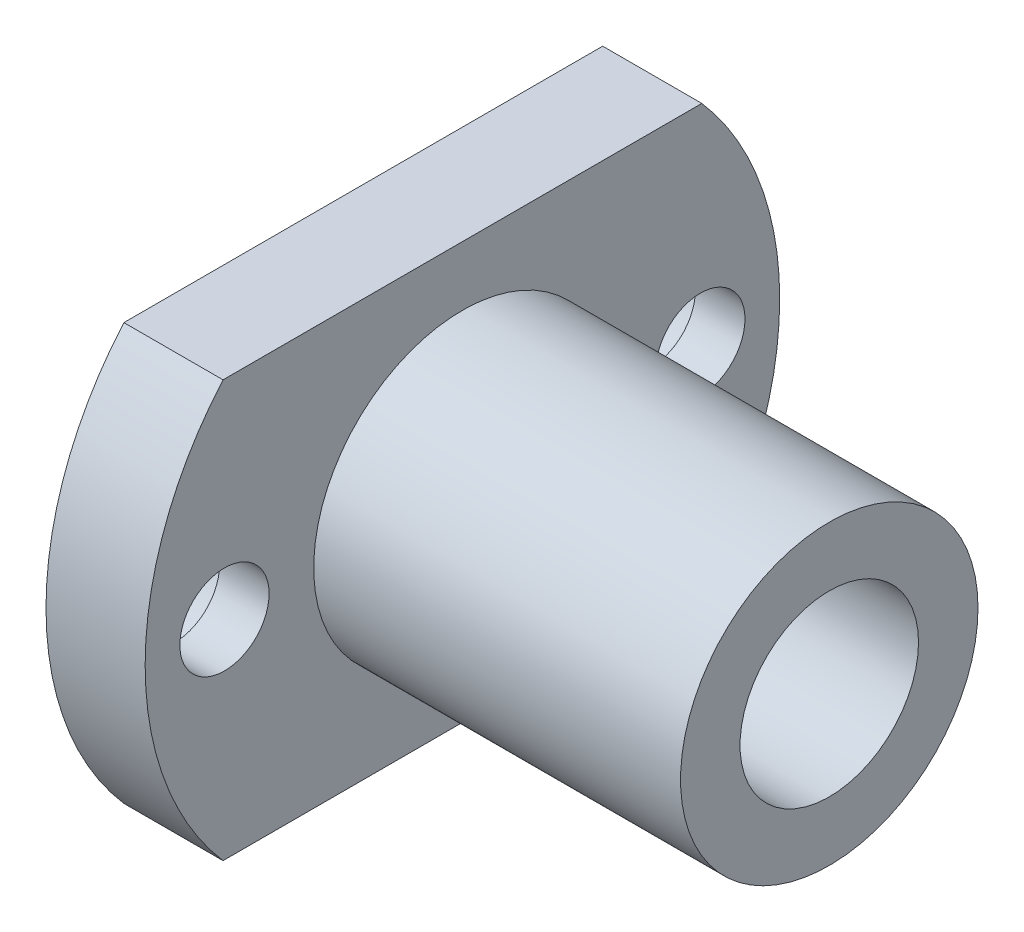
ISO-10303-21;
HEADER;
FILE_DESCRIPTION(('STEP AP214'),'2;1');
FILE_NAME('part.step','',(''),(''),'','','');
FILE_SCHEMA(('AUTOMOTIVE_DESIGN { 1 0 10303 214 1 1 1 1 }'));
ENDSEC;
DATA;
#1=APPLICATION_CONTEXT('core data for automotive mechanical design processes');
#2=APPLICATION_PROTOCOL_DEFINITION('international standard','automotive_design',2000,#1);
#3=PRODUCT_CONTEXT('',#1,'mechanical');
#4=PRODUCT('Part','Part','',(#3));
#5=PRODUCT_RELATED_PRODUCT_CATEGORY('part','',(#4));
#6=PRODUCT_DEFINITION_FORMATION('','',#4);
#7=PRODUCT_DEFINITION_CONTEXT('part definition',#1,'design');
#8=PRODUCT_DEFINITION('design','',#6,#7);
#9=PRODUCT_DEFINITION_SHAPE('','',#8);
#10=(LENGTH_UNIT() NAMED_UNIT(*) SI_UNIT(.MILLI.,.METRE.));
#11=(NAMED_UNIT(*) PLANE_ANGLE_UNIT() SI_UNIT($,.RADIAN.));
#12=(NAMED_UNIT(*) SI_UNIT($,.STERADIAN.) SOLID_ANGLE_UNIT());
#13=UNCERTAINTY_MEASURE_WITH_UNIT(LENGTH_MEASURE(1.E-05),#10,'distance_accuracy_value','');
#14=(GEOMETRIC_REPRESENTATION_CONTEXT(3) GLOBAL_UNCERTAINTY_ASSIGNED_CONTEXT((#13)) GLOBAL_UNIT_ASSIGNED_CONTEXT((#10,
#11,#12)) REPRESENTATION_CONTEXT('',''));
#15=CARTESIAN_POINT('',(0.,0.,0.));
#16=DIRECTION('',(0.,0.,1.));
#17=DIRECTION('',(1.,0.,0.));
#18=AXIS2_PLACEMENT_3D('',#15,#16,#17);
#19=CARTESIAN_POINT('',(5.,0.,0.));
#20=DIRECTION('',(-1.,0.,0.));
#21=DIRECTION('',(0.,0.,1.));
#22=AXIS2_PLACEMENT_3D('',#19,#20,#21);
#23=CYLINDRICAL_SURFACE('',#22,16.);
#24=CARTESIAN_POINT('',(0.,0.,0.));
#25=DIRECTION('',(1.,0.,0.));
#26=DIRECTION('',(0.,0.,-1.));
#27=AXIS2_PLACEMENT_3D('',#24,#25,#26);
#28=CIRCLE('',#27,16.);
#29=CARTESIAN_POINT('',(0.,10.5,12.0726964676496));
#30=VERTEX_POINT('',#29);
#31=CARTESIAN_POINT('',(0.,-10.5,12.0726964676496));
#32=VERTEX_POINT('',#31);
#33=EDGE_CURVE('E104',#30,#32,#28,.T.);
#34=ORIENTED_EDGE('',*,*,#33,.T.);
#35=DIRECTION('',(-1.,0.,0.));
#36=VECTOR('',#35,1.);
#37=CARTESIAN_POINT('',(5.,-10.5,12.0726964676496));
#38=LINE('',#37,#36);
#39=CARTESIAN_POINT('',(5.,-10.5,12.0726964676496));
#40=VERTEX_POINT('',#39);
#41=EDGE_CURVE('E11',#40,#32,#38,.T.);
#42=ORIENTED_EDGE('',*,*,#41,.F.);
#43=CARTESIAN_POINT('',(5.,0.,0.));
#44=DIRECTION('',(1.,0.,0.));
#45=DIRECTION('',(0.,0.,-1.));
#46=AXIS2_PLACEMENT_3D('',#43,#44,#45);
#47=CIRCLE('',#46,16.);
#48=CARTESIAN_POINT('',(5.,10.5,12.0726964676496));
#49=VERTEX_POINT('',#48);
#50=EDGE_CURVE('E92',#49,#40,#47,.T.);
#51=ORIENTED_EDGE('',*,*,#50,.F.);
#52=DIRECTION('',(-1.,0.,0.));
#53=VECTOR('',#52,1.);
#54=CARTESIAN_POINT('',(5.,10.5,12.0726964676496));
#55=LINE('',#54,#53);
#56=EDGE_CURVE('E100',#49,#30,#55,.T.);
#57=ORIENTED_EDGE('',*,*,#56,.T.);
#58=EDGE_LOOP('',(#34,#42,#51,#57));
#59=FACE_BOUND('',#58,.T.);
#60=ADVANCED_FACE('F41',(#59),#23,.T.);
#61=CARTESIAN_POINT('',(5.,-10.5,12.0726964676496));
#62=DIRECTION('',(0.,1.,0.));
#63=DIRECTION('',(0.,0.,1.));
#64=AXIS2_PLACEMENT_3D('',#61,#62,#63);
#65=PLANE('',#64);
#66=DIRECTION('',(0.,0.,-1.));
#67=VECTOR('',#66,1.);
#68=CARTESIAN_POINT('',(0.,-10.5,12.0726964676496));
#69=LINE('',#68,#67);
#70=CARTESIAN_POINT('',(0.,-10.5,-12.0726964676496));
#71=VERTEX_POINT('',#70);
#72=EDGE_CURVE('E96',#32,#71,#69,.T.);
#73=ORIENTED_EDGE('',*,*,#72,.T.);
#74=DIRECTION('',(-1.,0.,0.));
#75=VECTOR('',#74,1.);
#76=CARTESIAN_POINT('',(5.,-10.5,-12.0726964676496));
#77=LINE('',#76,#75);
#78=CARTESIAN_POINT('',(5.,-10.5,-12.0726964676496));
#79=VERTEX_POINT('',#78);
#80=EDGE_CURVE('E49',#79,#71,#77,.T.);
#81=ORIENTED_EDGE('',*,*,#80,.F.);
#82=DIRECTION('',(0.,0.,-1.));
#83=VECTOR('',#82,1.);
#84=CARTESIAN_POINT('',(5.,-10.5,12.0726964676496));
#85=LINE('',#84,#83);
#86=EDGE_CURVE('E87',#40,#79,#85,.T.);
#87=ORIENTED_EDGE('',*,*,#86,.F.);
#88=ORIENTED_EDGE('',*,*,#41,.T.);
#89=EDGE_LOOP('',(#73,#81,#87,#88));
#90=FACE_BOUND('',#89,.T.);
#91=ADVANCED_FACE('F95',(#90),#65,.F.);
#92=CARTESIAN_POINT('',(5.,0.,0.));
#93=DIRECTION('',(-1.,0.,0.));
#94=DIRECTION('',(0.,0.,1.));
#95=AXIS2_PLACEMENT_3D('',#92,#93,#94);
#96=CYLINDRICAL_SURFACE('',#95,16.);
#97=CARTESIAN_POINT('',(0.,0.,0.));
#98=DIRECTION('',(1.,0.,0.));
#99=DIRECTION('',(0.,0.,-1.));
#100=AXIS2_PLACEMENT_3D('',#97,#98,#99);
#101=CIRCLE('',#100,16.);
#102=CARTESIAN_POINT('',(0.,10.5,-12.0726964676496));
#103=VERTEX_POINT('',#102);
#104=EDGE_CURVE('E74',#71,#103,#101,.T.);
#105=ORIENTED_EDGE('',*,*,#104,.T.);
#106=DIRECTION('',(-1.,0.,0.));
#107=VECTOR('',#106,1.);
#108=CARTESIAN_POINT('',(5.,10.5,-12.0726964676496));
#109=LINE('',#108,#107);
#110=CARTESIAN_POINT('',(5.,10.5,-12.0726964676496));
#111=VERTEX_POINT('',#110);
#112=EDGE_CURVE('E97',#111,#103,#109,.T.);
#113=ORIENTED_EDGE('',*,*,#112,.F.);
#114=CARTESIAN_POINT('',(5.,0.,0.));
#115=DIRECTION('',(1.,0.,0.));
#116=DIRECTION('',(0.,0.,-1.));
#117=AXIS2_PLACEMENT_3D('',#114,#115,#116);
#118=CIRCLE('',#117,16.);
#119=EDGE_CURVE('E90',#79,#111,#118,.T.);
#120=ORIENTED_EDGE('',*,*,#119,.F.);
#121=ORIENTED_EDGE('',*,*,#80,.T.);
#122=EDGE_LOOP('',(#105,#113,#120,#121));
#123=FACE_BOUND('',#122,.T.);
#124=ADVANCED_FACE('F98',(#123),#96,.T.);
#125=CARTESIAN_POINT('',(5.,10.5,12.0726964676496));
#126=DIRECTION('',(0.,-1.,0.));
#127=DIRECTION('',(0.,0.,-1.));
#128=AXIS2_PLACEMENT_3D('',#125,#126,#127);
#129=PLANE('',#128);
#130=DIRECTION('',(0.,0.,1.));
#131=VECTOR('',#130,1.);
#132=CARTESIAN_POINT('',(0.,10.5,12.0726964676496));
#133=LINE('',#132,#131);
#134=EDGE_CURVE('E80',#103,#30,#133,.T.);
#135=ORIENTED_EDGE('',*,*,#134,.T.);
#136=ORIENTED_EDGE('',*,*,#56,.F.);
#137=DIRECTION('',(0.,0.,1.));
#138=VECTOR('',#137,1.);
#139=CARTESIAN_POINT('',(5.,10.5,12.0726964676496));
#140=LINE('',#139,#138);
#141=EDGE_CURVE('E57',#111,#49,#140,.T.);
#142=ORIENTED_EDGE('',*,*,#141,.F.);
#143=ORIENTED_EDGE('',*,*,#112,.T.);
#144=EDGE_LOOP('',(#135,#136,#142,#143));
#145=FACE_BOUND('',#144,.T.);
#146=ADVANCED_FACE('F112',(#145),#129,.F.);
#147=CARTESIAN_POINT('',(5.,0.,0.));
#148=DIRECTION('',(1.,0.,0.));
#149=DIRECTION('',(0.,0.,-1.));
#150=AXIS2_PLACEMENT_3D('',#147,#148,#149);
#151=PLANE('',#150);
#152=CARTESIAN_POINT('',(5.,0.,0.));
#153=DIRECTION('',(1.,0.,0.));
#154=DIRECTION('',(0.,0.,-1.));
#155=AXIS2_PLACEMENT_3D('',#152,#153,#154);
#156=CIRCLE('',#155,7.5);
#157=CARTESIAN_POINT('',(5.,0.,-7.5));
#158=VERTEX_POINT('',#157);
#159=EDGE_CURVE('E132',#158,#158,#156,.T.);
#160=ORIENTED_EDGE('',*,*,#159,.F.);
#161=EDGE_LOOP('',(#160));
#162=FACE_BOUND('',#161,.T.);
#163=CARTESIAN_POINT('',(5.,0.,12.));
#164=DIRECTION('',(1.,0.,0.));
#165=DIRECTION('',(0.,0.,-1.));
#166=AXIS2_PLACEMENT_3D('',#163,#164,#165);
#167=CIRCLE('',#166,2.25);
#168=CARTESIAN_POINT('',(5.,0.,9.75));
#169=VERTEX_POINT('',#168);
#170=EDGE_CURVE('E107',#169,#169,#167,.T.);
#171=ORIENTED_EDGE('',*,*,#170,.F.);
#172=EDGE_LOOP('',(#171));
#173=FACE_BOUND('',#172,.T.);
#174=CARTESIAN_POINT('',(5.,0.,-12.));
#175=DIRECTION('',(1.,0.,0.));
#176=DIRECTION('',(0.,0.,-1.));
#177=AXIS2_PLACEMENT_3D('',#174,#175,#176);
#178=CIRCLE('',#177,2.25);
#179=CARTESIAN_POINT('',(5.,0.,-14.25));
#180=VERTEX_POINT('',#179);
#181=EDGE_CURVE('E123',#180,#180,#178,.T.);
#182=ORIENTED_EDGE('',*,*,#181,.F.);
#183=EDGE_LOOP('',(#182));
#184=FACE_BOUND('',#183,.T.);
#185=ORIENTED_EDGE('',*,*,#50,.T.);
#186=ORIENTED_EDGE('',*,*,#86,.T.);
#187=ORIENTED_EDGE('',*,*,#119,.T.);
#188=ORIENTED_EDGE('',*,*,#141,.T.);
#189=EDGE_LOOP('',(#185,#186,#187,#188));
#190=FACE_BOUND('',#189,.T.);
#191=ADVANCED_FACE('F88',(#162,#173,#184,#190),#151,.T.);
#192=CARTESIAN_POINT('',(0.,0.,0.));
#193=DIRECTION('',(1.,0.,0.));
#194=DIRECTION('',(0.,0.,-1.));
#195=AXIS2_PLACEMENT_3D('',#192,#193,#194);
#196=PLANE('',#195);
#197=CARTESIAN_POINT('',(0.,0.,-12.));
#198=DIRECTION('',(-1.,0.,0.));
#199=DIRECTION('',(0.,0.,1.));
#200=AXIS2_PLACEMENT_3D('',#197,#198,#199);
#201=CIRCLE('',#200,3.25);
#202=CARTESIAN_POINT('',(0.,0.,-8.75));
#203=VERTEX_POINT('',#202);
#204=EDGE_CURVE('E148',#203,#203,#201,.T.);
#205=ORIENTED_EDGE('',*,*,#204,.F.);
#206=EDGE_LOOP('',(#205));
#207=FACE_BOUND('',#206,.T.);
#208=CARTESIAN_POINT('',(0.,0.,12.));
#209=DIRECTION('',(-1.,0.,0.));
#210=DIRECTION('',(0.,0.,1.));
#211=AXIS2_PLACEMENT_3D('',#208,#209,#210);
#212=CIRCLE('',#211,3.25);
#213=CARTESIAN_POINT('',(0.,0.,15.25));
#214=VERTEX_POINT('',#213);
#215=EDGE_CURVE('E142',#214,#214,#212,.T.);
#216=ORIENTED_EDGE('',*,*,#215,.F.);
#217=EDGE_LOOP('',(#216));
#218=FACE_BOUND('',#217,.T.);
#219=CARTESIAN_POINT('',(0.,0.,0.));
#220=DIRECTION('',(1.,0.,0.));
#221=DIRECTION('',(0.,0.,-1.));
#222=AXIS2_PLACEMENT_3D('',#219,#220,#221);
#223=CIRCLE('',#222,4.5);
#224=CARTESIAN_POINT('',(0.,0.,-4.5));
#225=VERTEX_POINT('',#224);
#226=EDGE_CURVE('E135',#225,#225,#223,.T.);
#227=ORIENTED_EDGE('',*,*,#226,.T.);
#228=EDGE_LOOP('',(#227));
#229=FACE_BOUND('',#228,.T.);
#230=ORIENTED_EDGE('',*,*,#33,.F.);
#231=ORIENTED_EDGE('',*,*,#134,.F.);
#232=ORIENTED_EDGE('',*,*,#104,.F.);
#233=ORIENTED_EDGE('',*,*,#72,.F.);
#234=EDGE_LOOP('',(#230,#231,#232,#233));
#235=FACE_BOUND('',#234,.T.);
#236=ADVANCED_FACE('F115',(#207,#218,#229,#235),#196,.F.);
#237=CARTESIAN_POINT('',(2.5,0.,-12.));
#238=DIRECTION('',(1.,0.,0.));
#239=DIRECTION('',(0.,0.,-1.));
#240=AXIS2_PLACEMENT_3D('',#237,#238,#239);
#241=CYLINDRICAL_SURFACE('',#240,2.25);
#242=CARTESIAN_POINT('',(2.5,0.,-12.));
#243=DIRECTION('',(1.,0.,0.));
#244=DIRECTION('',(0.,0.,-1.));
#245=AXIS2_PLACEMENT_3D('',#242,#243,#244);
#246=CIRCLE('',#245,2.25);
#247=CARTESIAN_POINT('',(2.5,0.,-14.25));
#248=VERTEX_POINT('',#247);
#249=EDGE_CURVE('E118',#248,#248,#246,.T.);
#250=ORIENTED_EDGE('',*,*,#249,.F.);
#251=EDGE_LOOP('',(#250));
#252=FACE_BOUND('',#251,.T.);
#253=ORIENTED_EDGE('',*,*,#181,.T.);
#254=EDGE_LOOP('',(#253));
#255=FACE_BOUND('',#254,.T.);
#256=ADVANCED_FACE('F165',(#252,#255),#241,.F.);
#257=CARTESIAN_POINT('',(2.5,0.,12.));
#258=DIRECTION('',(1.,0.,0.));
#259=DIRECTION('',(0.,0.,-1.));
#260=AXIS2_PLACEMENT_3D('',#257,#258,#259);
#261=CYLINDRICAL_SURFACE('',#260,2.25);
#262=CARTESIAN_POINT('',(2.5,0.,12.));
#263=DIRECTION('',(1.,0.,0.));
#264=DIRECTION('',(0.,0.,-1.));
#265=AXIS2_PLACEMENT_3D('',#262,#263,#264);
#266=CIRCLE('',#265,2.25);
#267=CARTESIAN_POINT('',(2.5,0.,9.75));
#268=VERTEX_POINT('',#267);
#269=EDGE_CURVE('E122',#268,#268,#266,.T.);
#270=ORIENTED_EDGE('',*,*,#269,.F.);
#271=EDGE_LOOP('',(#270));
#272=FACE_BOUND('',#271,.T.);
#273=ORIENTED_EDGE('',*,*,#170,.T.);
#274=EDGE_LOOP('',(#273));
#275=FACE_BOUND('',#274,.T.);
#276=ADVANCED_FACE('F187',(#272,#275),#261,.F.);
#277=CARTESIAN_POINT('',(23.5,0.,0.));
#278=DIRECTION('',(-1.,0.,0.));
#279=DIRECTION('',(0.,0.,1.));
#280=AXIS2_PLACEMENT_3D('',#277,#278,#279);
#281=CYLINDRICAL_SURFACE('',#280,7.5);
#282=CARTESIAN_POINT('',(23.5,0.,0.));
#283=DIRECTION('',(1.,0.,0.));
#284=DIRECTION('',(0.,0.,-1.));
#285=AXIS2_PLACEMENT_3D('',#282,#283,#284);
#286=CIRCLE('',#285,7.5);
#287=CARTESIAN_POINT('',(23.5,0.,-7.5));
#288=VERTEX_POINT('',#287);
#289=EDGE_CURVE('E126',#288,#288,#286,.T.);
#290=ORIENTED_EDGE('',*,*,#289,.F.);
#291=EDGE_LOOP('',(#290));
#292=FACE_BOUND('',#291,.T.);
#293=ORIENTED_EDGE('',*,*,#159,.T.);
#294=EDGE_LOOP('',(#293));
#295=FACE_BOUND('',#294,.T.);
#296=ADVANCED_FACE('F181',(#292,#295),#281,.T.);
#297=CARTESIAN_POINT('',(23.5,0.,0.));
#298=DIRECTION('',(1.,0.,0.));
#299=DIRECTION('',(0.,0.,-1.));
#300=AXIS2_PLACEMENT_3D('',#297,#298,#299);
#301=PLANE('',#300);
#302=CARTESIAN_POINT('',(23.5,0.,0.));
#303=DIRECTION('',(1.,0.,0.));
#304=DIRECTION('',(0.,0.,-1.));
#305=AXIS2_PLACEMENT_3D('',#302,#303,#304);
#306=CIRCLE('',#305,4.5);
#307=CARTESIAN_POINT('',(23.5,0.,-4.5));
#308=VERTEX_POINT('',#307);
#309=EDGE_CURVE('E121',#308,#308,#306,.T.);
#310=ORIENTED_EDGE('',*,*,#309,.F.);
#311=EDGE_LOOP('',(#310));
#312=FACE_BOUND('',#311,.T.);
#313=ORIENTED_EDGE('',*,*,#289,.T.);
#314=EDGE_LOOP('',(#313));
#315=FACE_BOUND('',#314,.T.);
#316=ADVANCED_FACE('F175',(#312,#315),#301,.T.);
#317=CARTESIAN_POINT('',(0.,0.,0.));
#318=DIRECTION('',(1.,0.,0.));
#319=DIRECTION('',(0.,0.,-1.));
#320=AXIS2_PLACEMENT_3D('',#317,#318,#319);
#321=CYLINDRICAL_SURFACE('',#320,4.5);
#322=ORIENTED_EDGE('',*,*,#226,.F.);
#323=EDGE_LOOP('',(#322));
#324=FACE_BOUND('',#323,.T.);
#325=ORIENTED_EDGE('',*,*,#309,.T.);
#326=EDGE_LOOP('',(#325));
#327=FACE_BOUND('',#326,.T.);
#328=ADVANCED_FACE('F171',(#324,#327),#321,.F.);
#329=CARTESIAN_POINT('',(2.5,0.,12.));
#330=DIRECTION('',(-1.,0.,0.));
#331=DIRECTION('',(0.,0.,1.));
#332=AXIS2_PLACEMENT_3D('',#329,#330,#331);
#333=PLANE('',#332);
#334=CARTESIAN_POINT('',(2.5,0.,12.));
#335=DIRECTION('',(-1.,0.,0.));
#336=DIRECTION('',(0.,0.,1.));
#337=AXIS2_PLACEMENT_3D('',#334,#335,#336);
#338=CIRCLE('',#337,3.25);
#339=CARTESIAN_POINT('',(2.5,0.,15.25));
#340=VERTEX_POINT('',#339);
#341=EDGE_CURVE('E145',#340,#340,#338,.T.);
#342=ORIENTED_EDGE('',*,*,#341,.T.);
#343=EDGE_LOOP('',(#342));
#344=FACE_BOUND('',#343,.T.);
#345=ORIENTED_EDGE('',*,*,#269,.T.);
#346=EDGE_LOOP('',(#345));
#347=FACE_BOUND('',#346,.T.);
#348=ADVANCED_FACE('F174',(#344,#347),#333,.T.);
#349=CARTESIAN_POINT('',(2.5,0.,12.));
#350=DIRECTION('',(-1.,0.,0.));
#351=DIRECTION('',(0.,0.,1.));
#352=AXIS2_PLACEMENT_3D('',#349,#350,#351);
#353=CYLINDRICAL_SURFACE('',#352,3.25);
#354=ORIENTED_EDGE('',*,*,#341,.F.);
#355=EDGE_LOOP('',(#354));
#356=FACE_BOUND('',#355,.T.);
#357=ORIENTED_EDGE('',*,*,#215,.T.);
#358=EDGE_LOOP('',(#357));
#359=FACE_BOUND('',#358,.T.);
#360=ADVANCED_FACE('F243',(#356,#359),#353,.F.);
#361=CARTESIAN_POINT('',(2.5,0.,-12.));
#362=DIRECTION('',(-1.,0.,0.));
#363=DIRECTION('',(0.,0.,1.));
#364=AXIS2_PLACEMENT_3D('',#361,#362,#363);
#365=PLANE('',#364);
#366=CARTESIAN_POINT('',(2.5,0.,-12.));
#367=DIRECTION('',(-1.,0.,0.));
#368=DIRECTION('',(0.,0.,1.));
#369=AXIS2_PLACEMENT_3D('',#366,#367,#368);
#370=CIRCLE('',#369,3.25);
#371=CARTESIAN_POINT('',(2.5,0.,-8.75));
#372=VERTEX_POINT('',#371);
#373=EDGE_CURVE('E131',#372,#372,#370,.T.);
#374=ORIENTED_EDGE('',*,*,#373,.T.);
#375=EDGE_LOOP('',(#374));
#376=FACE_BOUND('',#375,.T.);
#377=ORIENTED_EDGE('',*,*,#249,.T.);
#378=EDGE_LOOP('',(#377));
#379=FACE_BOUND('',#378,.T.);
#380=ADVANCED_FACE('F154',(#376,#379),#365,.T.);
#381=CARTESIAN_POINT('',(2.5,0.,-12.));
#382=DIRECTION('',(-1.,0.,0.));
#383=DIRECTION('',(0.,0.,1.));
#384=AXIS2_PLACEMENT_3D('',#381,#382,#383);
#385=CYLINDRICAL_SURFACE('',#384,3.25);
#386=ORIENTED_EDGE('',*,*,#373,.F.);
#387=EDGE_LOOP('',(#386));
#388=FACE_BOUND('',#387,.T.);
#389=ORIENTED_EDGE('',*,*,#204,.T.);
#390=EDGE_LOOP('',(#389));
#391=FACE_BOUND('',#390,.T.);
#392=ADVANCED_FACE('F157',(#388,#391),#385,.F.);
#393=CLOSED_SHELL('',(#60,#91,#124,#146,#191,#236,#256,#276,#296,#316,#328,#348,#360,#380,#392));
#394=MANIFOLD_SOLID_BREP('B2',#393);
#395=ADVANCED_BREP_SHAPE_REPRESENTATION('',(#18,#394),#14);
#396=SHAPE_DEFINITION_REPRESENTATION(#9,#395);
ENDSEC;
END-ISO-10303-21;
